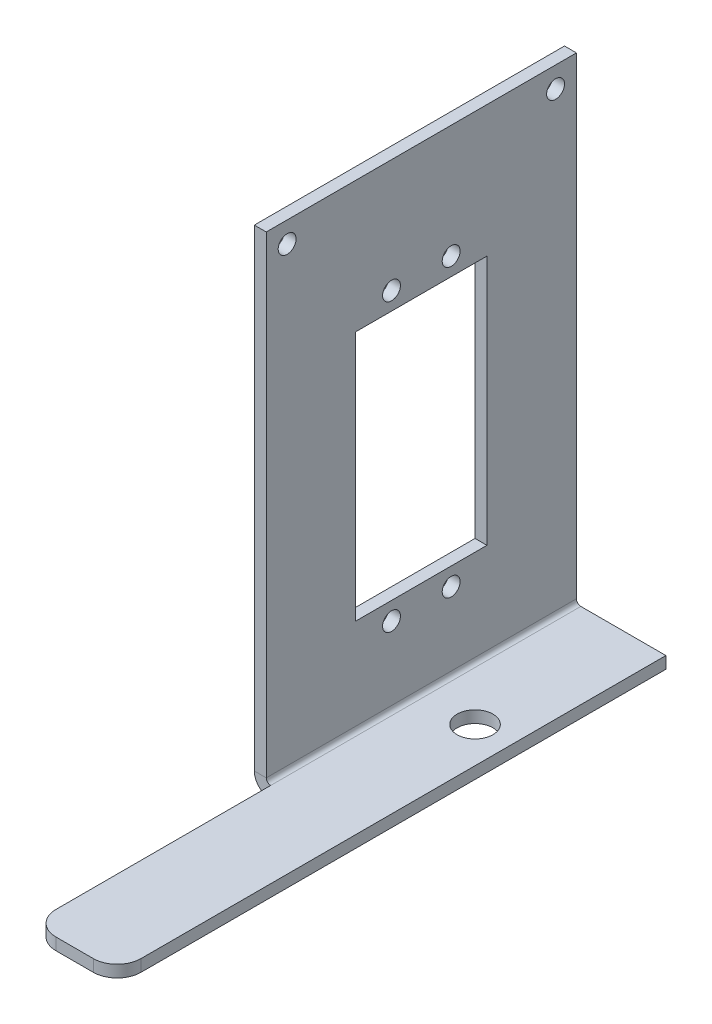
ISO-10303-21;
HEADER;
FILE_DESCRIPTION(('STEP AP214'),'2;1');
FILE_NAME('part.step','',(''),(''),'','','');
FILE_SCHEMA(('AUTOMOTIVE_DESIGN { 1 0 10303 214 1 1 1 1 }'));
ENDSEC;
DATA;
#1=APPLICATION_CONTEXT('core data for automotive mechanical design processes');
#2=APPLICATION_PROTOCOL_DEFINITION('international standard','automotive_design',2000,#1);
#3=PRODUCT_CONTEXT('',#1,'mechanical');
#4=PRODUCT('Part','Part','',(#3));
#5=PRODUCT_RELATED_PRODUCT_CATEGORY('part','',(#4));
#6=PRODUCT_DEFINITION_FORMATION('','',#4);
#7=PRODUCT_DEFINITION_CONTEXT('part definition',#1,'design');
#8=PRODUCT_DEFINITION('design','',#6,#7);
#9=PRODUCT_DEFINITION_SHAPE('','',#8);
#10=(LENGTH_UNIT() NAMED_UNIT(*) SI_UNIT(.MILLI.,.METRE.));
#11=(NAMED_UNIT(*) PLANE_ANGLE_UNIT() SI_UNIT($,.RADIAN.));
#12=(NAMED_UNIT(*) SI_UNIT($,.STERADIAN.) SOLID_ANGLE_UNIT());
#13=UNCERTAINTY_MEASURE_WITH_UNIT(LENGTH_MEASURE(1.E-05),#10,'distance_accuracy_value','');
#14=(GEOMETRIC_REPRESENTATION_CONTEXT(3) GLOBAL_UNCERTAINTY_ASSIGNED_CONTEXT((#13)) GLOBAL_UNIT_ASSIGNED_CONTEXT((#10,
#11,#12)) REPRESENTATION_CONTEXT('',''));
#15=CARTESIAN_POINT('',(0.,0.,0.));
#16=DIRECTION('',(0.,0.,1.));
#17=DIRECTION('',(1.,0.,0.));
#18=AXIS2_PLACEMENT_3D('',#15,#16,#17);
#19=CARTESIAN_POINT('',(0.7366,0.,52.));
#20=DIRECTION('',(0.,0.,1.));
#21=DIRECTION('',(1.,0.,0.));
#22=AXIS2_PLACEMENT_3D('',#19,#20,#21);
#23=PLANE('',#22);
#24=DIRECTION('',(0.,-1.,0.));
#25=VECTOR('',#24,1.);
#26=CARTESIAN_POINT('',(0.7366,0.,52.));
#27=LINE('',#26,#25);
#28=CARTESIAN_POINT('',(0.7366,0.,52.));
#29=VERTEX_POINT('',#28);
#30=CARTESIAN_POINT('',(0.7366,-2.,52.));
#31=VERTEX_POINT('',#30);
#32=EDGE_CURVE('E286',#29,#31,#27,.T.);
#33=ORIENTED_EDGE('',*,*,#32,.F.);
#34=CARTESIAN_POINT('',(0.7366,0.7366,52.));
#35=DIRECTION('',(0.,0.,-1.));
#36=DIRECTION('',(-1.,0.,0.));
#37=AXIS2_PLACEMENT_3D('',#34,#35,#36);
#38=CIRCLE('',#37,0.7366);
#39=CARTESIAN_POINT('',(0.,0.7366,52.));
#40=VERTEX_POINT('',#39);
#41=EDGE_CURVE('E298',#40,#29,#38,.F.);
#42=ORIENTED_EDGE('',*,*,#41,.F.);
#43=DIRECTION('',(1.,0.,0.));
#44=VECTOR('',#43,1.);
#45=CARTESIAN_POINT('',(-2.,0.7366,52.));
#46=LINE('',#45,#44);
#47=CARTESIAN_POINT('',(-2.,0.7366,52.));
#48=VERTEX_POINT('',#47);
#49=EDGE_CURVE('E304',#48,#40,#46,.T.);
#50=ORIENTED_EDGE('',*,*,#49,.F.);
#51=CARTESIAN_POINT('',(0.7366,0.7366,52.));
#52=DIRECTION('',(0.,0.,1.));
#53=DIRECTION('',(1.,0.,0.));
#54=AXIS2_PLACEMENT_3D('',#51,#52,#53);
#55=CIRCLE('',#54,2.7366);
#56=EDGE_CURVE('E301',#48,#31,#55,.T.);
#57=ORIENTED_EDGE('',*,*,#56,.T.);
#58=EDGE_LOOP('',(#33,#42,#50,#57));
#59=FACE_BOUND('',#58,.T.);
#60=ADVANCED_FACE('F178',(#59),#23,.T.);
#61=CARTESIAN_POINT('',(0.,0.7366,0.));
#62=DIRECTION('',(0.,0.,-1.));
#63=DIRECTION('',(-1.,0.,0.));
#64=AXIS2_PLACEMENT_3D('',#61,#62,#63);
#65=PLANE('',#64);
#66=DIRECTION('',(-1.,0.,0.));
#67=VECTOR('',#66,1.);
#68=CARTESIAN_POINT('',(0.,0.7366,0.));
#69=LINE('',#68,#67);
#70=CARTESIAN_POINT('',(0.,0.7366,0.));
#71=VERTEX_POINT('',#70);
#72=CARTESIAN_POINT('',(-2.,0.7366,0.));
#73=VERTEX_POINT('',#72);
#74=EDGE_CURVE('E373',#71,#73,#69,.T.);
#75=ORIENTED_EDGE('',*,*,#74,.F.);
#76=CARTESIAN_POINT('',(0.7366,0.7366,0.));
#77=DIRECTION('',(0.,0.,-1.));
#78=DIRECTION('',(-1.,0.,0.));
#79=AXIS2_PLACEMENT_3D('',#76,#77,#78);
#80=CIRCLE('',#79,0.7366);
#81=CARTESIAN_POINT('',(0.7366,0.,0.));
#82=VERTEX_POINT('',#81);
#83=EDGE_CURVE('E348',#71,#82,#80,.F.);
#84=ORIENTED_EDGE('',*,*,#83,.T.);
#85=DIRECTION('',(0.,1.,0.));
#86=VECTOR('',#85,1.);
#87=CARTESIAN_POINT('',(0.7366,-2.,0.));
#88=LINE('',#87,#86);
#89=CARTESIAN_POINT('',(0.7366,-2.,0.));
#90=VERTEX_POINT('',#89);
#91=EDGE_CURVE('E371',#90,#82,#88,.T.);
#92=ORIENTED_EDGE('',*,*,#91,.F.);
#93=CARTESIAN_POINT('',(0.7366,0.7366,0.));
#94=DIRECTION('',(0.,0.,1.));
#95=DIRECTION('',(1.,0.,0.));
#96=AXIS2_PLACEMENT_3D('',#93,#94,#95);
#97=CIRCLE('',#96,2.7366);
#98=EDGE_CURVE('E322',#73,#90,#97,.T.);
#99=ORIENTED_EDGE('',*,*,#98,.F.);
#100=EDGE_LOOP('',(#75,#84,#92,#99));
#101=FACE_BOUND('',#100,.T.);
#102=ADVANCED_FACE('F497',(#101),#65,.T.);
#103=CARTESIAN_POINT('',(0.7366,-2.,0.));
#104=DIRECTION('',(0.,0.,-1.));
#105=DIRECTION('',(-1.,0.,0.));
#106=AXIS2_PLACEMENT_3D('',#103,#104,#105);
#107=PLANE('',#106);
#108=DIRECTION('',(0.,-1.,0.));
#109=VECTOR('',#108,1.);
#110=CARTESIAN_POINT('',(0.,0.,0.));
#111=LINE('',#110,#109);
#112=CARTESIAN_POINT('',(0.,80.,0.));
#113=VERTEX_POINT('',#112);
#114=EDGE_CURVE('E350',#113,#71,#111,.T.);
#115=ORIENTED_EDGE('',*,*,#114,.T.);
#116=ORIENTED_EDGE('',*,*,#74,.T.);
#117=DIRECTION('',(0.,1.,0.));
#118=VECTOR('',#117,1.);
#119=CARTESIAN_POINT('',(-2.,0.,0.));
#120=LINE('',#119,#118);
#121=CARTESIAN_POINT('',(-2.,80.,0.));
#122=VERTEX_POINT('',#121);
#123=EDGE_CURVE('E327',#122,#73,#120,.F.);
#124=ORIENTED_EDGE('',*,*,#123,.F.);
#125=DIRECTION('',(1.,0.,0.));
#126=VECTOR('',#125,1.);
#127=CARTESIAN_POINT('',(-2.,80.,0.));
#128=LINE('',#127,#126);
#129=EDGE_CURVE('E353',#122,#113,#128,.T.);
#130=ORIENTED_EDGE('',*,*,#129,.T.);
#131=EDGE_LOOP('',(#115,#116,#124,#130));
#132=FACE_BOUND('',#131,.T.);
#133=ADVANCED_FACE('F502',(#132),#107,.T.);
#134=CARTESIAN_POINT('',(0.,-2.,52.));
#135=DIRECTION('',(0.,1.,0.));
#136=DIRECTION('',(0.,0.,1.));
#137=AXIS2_PLACEMENT_3D('',#134,#135,#136);
#138=PLANE('',#137);
#139=CARTESIAN_POINT('',(9.,-2.,26.));
#140=DIRECTION('',(0.,-1.,0.));
#141=DIRECTION('',(0.,0.,-1.));
#142=AXIS2_PLACEMENT_3D('',#139,#140,#141);
#143=CIRCLE('',#142,3.);
#144=CARTESIAN_POINT('',(9.,-2.,23.));
#145=VERTEX_POINT('',#144);
#146=EDGE_CURVE('E344',#145,#145,#143,.T.);
#147=ORIENTED_EDGE('',*,*,#146,.F.);
#148=EDGE_LOOP('',(#147));
#149=FACE_BOUND('',#148,.T.);
#150=DIRECTION('',(0.,0.,-1.));
#151=VECTOR('',#150,1.);
#152=CARTESIAN_POINT('',(15.,-2.,52.));
#153=LINE('',#152,#151);
#154=CARTESIAN_POINT('',(15.,-2.,88.));
#155=VERTEX_POINT('',#154);
#156=CARTESIAN_POINT('',(15.,-2.,0.));
#157=VERTEX_POINT('',#156);
#158=EDGE_CURVE('E369',#155,#157,#153,.T.);
#159=ORIENTED_EDGE('',*,*,#158,.F.);
#160=CARTESIAN_POINT('',(11.,-2.,88.));
#161=DIRECTION('',(0.,1.,0.));
#162=DIRECTION('',(0.,0.,1.));
#163=AXIS2_PLACEMENT_3D('',#160,#161,#162);
#164=CIRCLE('',#163,4.);
#165=CARTESIAN_POINT('',(11.,-2.,92.));
#166=VERTEX_POINT('',#165);
#167=EDGE_CURVE('E397',#155,#166,#164,.F.);
#168=ORIENTED_EDGE('',*,*,#167,.T.);
#169=DIRECTION('',(1.,0.,0.));
#170=VECTOR('',#169,1.);
#171=CARTESIAN_POINT('',(15.,-2.,92.));
#172=LINE('',#171,#170);
#173=CARTESIAN_POINT('',(4.7366,-2.,92.));
#174=VERTEX_POINT('',#173);
#175=EDGE_CURVE('E292',#174,#166,#172,.T.);
#176=ORIENTED_EDGE('',*,*,#175,.F.);
#177=CARTESIAN_POINT('',(4.7366,-2.,88.));
#178=DIRECTION('',(0.,1.,0.));
#179=DIRECTION('',(0.,0.,1.));
#180=AXIS2_PLACEMENT_3D('',#177,#178,#179);
#181=CIRCLE('',#180,4.);
#182=CARTESIAN_POINT('',(0.7366,-2.,88.));
#183=VERTEX_POINT('',#182);
#184=EDGE_CURVE('E395',#174,#183,#181,.F.);
#185=ORIENTED_EDGE('',*,*,#184,.T.);
#186=DIRECTION('',(0.,0.,1.));
#187=VECTOR('',#186,1.);
#188=CARTESIAN_POINT('',(0.7366,-2.,92.));
#189=LINE('',#188,#187);
#190=EDGE_CURVE('E418',#31,#183,#189,.T.);
#191=ORIENTED_EDGE('',*,*,#190,.F.);
#192=DIRECTION('',(0.,0.,-1.));
#193=VECTOR('',#192,1.);
#194=CARTESIAN_POINT('',(0.7366,-2.,52.));
#195=LINE('',#194,#193);
#196=EDGE_CURVE('E339',#31,#90,#195,.T.);
#197=ORIENTED_EDGE('',*,*,#196,.T.);
#198=DIRECTION('',(1.,0.,0.));
#199=VECTOR('',#198,1.);
#200=CARTESIAN_POINT('',(0.,-2.,0.));
#201=LINE('',#200,#199);
#202=EDGE_CURVE('E340',#90,#157,#201,.T.);
#203=ORIENTED_EDGE('',*,*,#202,.T.);
#204=EDGE_LOOP('',(#159,#168,#176,#185,#191,#197,#203));
#205=FACE_BOUND('',#204,.T.);
#206=ADVANCED_FACE('F415',(#149,#205),#138,.F.);
#207=CARTESIAN_POINT('',(15.,0.,52.));
#208=DIRECTION('',(1.,0.,0.));
#209=DIRECTION('',(0.,0.,-1.));
#210=AXIS2_PLACEMENT_3D('',#207,#208,#209);
#211=PLANE('',#210);
#212=DIRECTION('',(0.,0.,-1.));
#213=VECTOR('',#212,1.);
#214=CARTESIAN_POINT('',(15.,0.,52.));
#215=LINE('',#214,#213);
#216=CARTESIAN_POINT('',(15.,0.,88.));
#217=VERTEX_POINT('',#216);
#218=CARTESIAN_POINT('',(15.,0.,0.));
#219=VERTEX_POINT('',#218);
#220=EDGE_CURVE('E315',#217,#219,#215,.T.);
#221=ORIENTED_EDGE('',*,*,#220,.F.);
#222=DIRECTION('',(0.,-1.,0.));
#223=VECTOR('',#222,1.);
#224=CARTESIAN_POINT('',(15.,-2.,88.));
#225=LINE('',#224,#223);
#226=EDGE_CURVE('E392',#217,#155,#225,.T.);
#227=ORIENTED_EDGE('',*,*,#226,.T.);
#228=ORIENTED_EDGE('',*,*,#158,.T.);
#229=DIRECTION('',(0.,-1.,0.));
#230=VECTOR('',#229,1.);
#231=CARTESIAN_POINT('',(15.,0.,0.));
#232=LINE('',#231,#230);
#233=EDGE_CURVE('E343',#219,#157,#232,.T.);
#234=ORIENTED_EDGE('',*,*,#233,.F.);
#235=EDGE_LOOP('',(#221,#227,#228,#234));
#236=FACE_BOUND('',#235,.T.);
#237=ADVANCED_FACE('F410',(#236),#211,.T.);
#238=CARTESIAN_POINT('',(0.,0.,52.));
#239=DIRECTION('',(0.,1.,0.));
#240=DIRECTION('',(0.,0.,1.));
#241=AXIS2_PLACEMENT_3D('',#238,#239,#240);
#242=PLANE('',#241);
#243=CARTESIAN_POINT('',(9.,0.,26.));
#244=DIRECTION('',(0.,1.,0.));
#245=DIRECTION('',(0.,0.,1.));
#246=AXIS2_PLACEMENT_3D('',#243,#244,#245);
#247=CIRCLE('',#246,3.);
#248=CARTESIAN_POINT('',(9.,0.,29.));
#249=VERTEX_POINT('',#248);
#250=EDGE_CURVE('E330',#249,#249,#247,.F.);
#251=ORIENTED_EDGE('',*,*,#250,.T.);
#252=EDGE_LOOP('',(#251));
#253=FACE_BOUND('',#252,.T.);
#254=DIRECTION('',(1.,0.,0.));
#255=VECTOR('',#254,1.);
#256=CARTESIAN_POINT('',(15.,0.,92.));
#257=LINE('',#256,#255);
#258=CARTESIAN_POINT('',(4.7366,0.,92.));
#259=VERTEX_POINT('',#258);
#260=CARTESIAN_POINT('',(11.,0.,92.));
#261=VERTEX_POINT('',#260);
#262=EDGE_CURVE('E291',#259,#261,#257,.T.);
#263=ORIENTED_EDGE('',*,*,#262,.T.);
#264=CARTESIAN_POINT('',(11.,0.,88.));
#265=DIRECTION('',(0.,1.,0.));
#266=DIRECTION('',(0.,0.,1.));
#267=AXIS2_PLACEMENT_3D('',#264,#265,#266);
#268=CIRCLE('',#267,4.);
#269=EDGE_CURVE('E186',#261,#217,#268,.T.);
#270=ORIENTED_EDGE('',*,*,#269,.T.);
#271=ORIENTED_EDGE('',*,*,#220,.T.);
#272=DIRECTION('',(1.,0.,0.));
#273=VECTOR('',#272,1.);
#274=CARTESIAN_POINT('',(0.,0.,0.));
#275=LINE('',#274,#273);
#276=EDGE_CURVE('E311',#82,#219,#275,.T.);
#277=ORIENTED_EDGE('',*,*,#276,.F.);
#278=DIRECTION('',(0.,0.,-1.));
#279=VECTOR('',#278,1.);
#280=CARTESIAN_POINT('',(0.7366,0.,52.));
#281=LINE('',#280,#279);
#282=EDGE_CURVE('E308',#29,#82,#281,.T.);
#283=ORIENTED_EDGE('',*,*,#282,.F.);
#284=DIRECTION('',(0.,0.,1.));
#285=VECTOR('',#284,1.);
#286=CARTESIAN_POINT('',(0.7366,0.,92.));
#287=LINE('',#286,#285);
#288=CARTESIAN_POINT('',(0.7366,0.,88.));
#289=VERTEX_POINT('',#288);
#290=EDGE_CURVE('E283',#29,#289,#287,.T.);
#291=ORIENTED_EDGE('',*,*,#290,.T.);
#292=CARTESIAN_POINT('',(4.7366,0.,88.));
#293=DIRECTION('',(0.,1.,0.));
#294=DIRECTION('',(0.,0.,1.));
#295=AXIS2_PLACEMENT_3D('',#292,#293,#294);
#296=CIRCLE('',#295,4.);
#297=EDGE_CURVE('E403',#289,#259,#296,.T.);
#298=ORIENTED_EDGE('',*,*,#297,.T.);
#299=EDGE_LOOP('',(#263,#270,#271,#277,#283,#291,#298));
#300=FACE_BOUND('',#299,.T.);
#301=ADVANCED_FACE('F309',(#253,#300),#242,.T.);
#302=CARTESIAN_POINT('',(0.7366,0.7366,52.));
#303=DIRECTION('',(0.,0.,-1.));
#304=DIRECTION('',(-1.,0.,0.));
#305=AXIS2_PLACEMENT_3D('',#302,#303,#304);
#306=CYLINDRICAL_SURFACE('',#305,0.7366);
#307=ORIENTED_EDGE('',*,*,#83,.F.);
#308=DIRECTION('',(0.,0.,-1.));
#309=VECTOR('',#308,1.);
#310=CARTESIAN_POINT('',(0.,0.7366,52.));
#311=LINE('',#310,#309);
#312=EDGE_CURVE('E316',#40,#71,#311,.T.);
#313=ORIENTED_EDGE('',*,*,#312,.F.);
#314=ORIENTED_EDGE('',*,*,#41,.T.);
#315=ORIENTED_EDGE('',*,*,#282,.T.);
#316=EDGE_LOOP('',(#307,#313,#314,#315));
#317=FACE_BOUND('',#316,.T.);
#318=ADVANCED_FACE('F319',(#317),#306,.F.);
#319=CARTESIAN_POINT('',(0.,0.,52.));
#320=DIRECTION('',(1.,0.,0.));
#321=DIRECTION('',(0.,0.,-1.));
#322=AXIS2_PLACEMENT_3D('',#319,#320,#321);
#323=PLANE('',#322);
#324=DIRECTION('',(0.,1.,0.));
#325=VECTOR('',#324,1.);
#326=CARTESIAN_POINT('',(0.,16.,15.));
#327=LINE('',#326,#325);
#328=CARTESIAN_POINT('',(0.,16.,15.));
#329=VERTEX_POINT('',#328);
#330=CARTESIAN_POINT('',(0.,58.,15.));
#331=VERTEX_POINT('',#330);
#332=EDGE_CURVE('E423',#329,#331,#327,.T.);
#333=ORIENTED_EDGE('',*,*,#332,.F.);
#334=DIRECTION('',(0.,0.,-1.));
#335=VECTOR('',#334,1.);
#336=CARTESIAN_POINT('',(0.,16.,15.));
#337=LINE('',#336,#335);
#338=CARTESIAN_POINT('',(0.,16.,37.));
#339=VERTEX_POINT('',#338);
#340=EDGE_CURVE('E431',#339,#329,#337,.T.);
#341=ORIENTED_EDGE('',*,*,#340,.F.);
#342=DIRECTION('',(0.,-1.,0.));
#343=VECTOR('',#342,1.);
#344=CARTESIAN_POINT('',(0.,16.,37.));
#345=LINE('',#344,#343);
#346=CARTESIAN_POINT('',(0.,58.,37.));
#347=VERTEX_POINT('',#346);
#348=EDGE_CURVE('E428',#347,#339,#345,.T.);
#349=ORIENTED_EDGE('',*,*,#348,.F.);
#350=DIRECTION('',(0.,0.,1.));
#351=VECTOR('',#350,1.);
#352=CARTESIAN_POINT('',(0.,58.,15.));
#353=LINE('',#352,#351);
#354=EDGE_CURVE('E425',#331,#347,#353,.T.);
#355=ORIENTED_EDGE('',*,*,#354,.F.);
#356=EDGE_LOOP('',(#333,#341,#349,#355));
#357=FACE_BOUND('',#356,.T.);
#358=CARTESIAN_POINT('',(0.,61.,21.));
#359=DIRECTION('',(1.,0.,0.));
#360=DIRECTION('',(0.,0.,-1.));
#361=AXIS2_PLACEMENT_3D('',#358,#359,#360);
#362=CIRCLE('',#361,1.49999999999999);
#363=CARTESIAN_POINT('',(0.,61.,19.5));
#364=VERTEX_POINT('',#363);
#365=EDGE_CURVE('E446',#364,#364,#362,.T.);
#366=ORIENTED_EDGE('',*,*,#365,.F.);
#367=EDGE_LOOP('',(#366));
#368=FACE_BOUND('',#367,.T.);
#369=CARTESIAN_POINT('',(0.,13.,21.));
#370=DIRECTION('',(1.,0.,0.));
#371=DIRECTION('',(0.,0.,-1.));
#372=AXIS2_PLACEMENT_3D('',#369,#370,#371);
#373=CIRCLE('',#372,1.5);
#374=CARTESIAN_POINT('',(0.,13.,19.5));
#375=VERTEX_POINT('',#374);
#376=EDGE_CURVE('E452',#375,#375,#373,.T.);
#377=ORIENTED_EDGE('',*,*,#376,.F.);
#378=EDGE_LOOP('',(#377));
#379=FACE_BOUND('',#378,.T.);
#380=CARTESIAN_POINT('',(0.,13.,31.));
#381=DIRECTION('',(1.,0.,0.));
#382=DIRECTION('',(0.,0.,-1.));
#383=AXIS2_PLACEMENT_3D('',#380,#381,#382);
#384=CIRCLE('',#383,1.5);
#385=CARTESIAN_POINT('',(0.,13.,29.5));
#386=VERTEX_POINT('',#385);
#387=EDGE_CURVE('E458',#386,#386,#384,.T.);
#388=ORIENTED_EDGE('',*,*,#387,.F.);
#389=EDGE_LOOP('',(#388));
#390=FACE_BOUND('',#389,.T.);
#391=CARTESIAN_POINT('',(0.,61.,31.));
#392=DIRECTION('',(1.,0.,0.));
#393=DIRECTION('',(0.,0.,-1.));
#394=AXIS2_PLACEMENT_3D('',#391,#392,#393);
#395=CIRCLE('',#394,1.49999999999999);
#396=CARTESIAN_POINT('',(0.,61.,29.5));
#397=VERTEX_POINT('',#396);
#398=EDGE_CURVE('E464',#397,#397,#395,.T.);
#399=ORIENTED_EDGE('',*,*,#398,.F.);
#400=EDGE_LOOP('',(#399));
#401=FACE_BOUND('',#400,.T.);
#402=CARTESIAN_POINT('',(0.,76.5,3.5));
#403=DIRECTION('',(1.,0.,0.));
#404=DIRECTION('',(0.,0.,-1.));
#405=AXIS2_PLACEMENT_3D('',#402,#403,#404);
#406=CIRCLE('',#405,1.49999999999999);
#407=CARTESIAN_POINT('',(0.,76.5,2.));
#408=VERTEX_POINT('',#407);
#409=EDGE_CURVE('E376',#408,#408,#406,.T.);
#410=ORIENTED_EDGE('',*,*,#409,.F.);
#411=EDGE_LOOP('',(#410));
#412=FACE_BOUND('',#411,.T.);
#413=CARTESIAN_POINT('',(0.,76.5,48.5));
#414=DIRECTION('',(1.,0.,0.));
#415=DIRECTION('',(0.,0.,-1.));
#416=AXIS2_PLACEMENT_3D('',#413,#414,#415);
#417=CIRCLE('',#416,1.49999999999999);
#418=CARTESIAN_POINT('',(0.,76.5,47.));
#419=VERTEX_POINT('',#418);
#420=EDGE_CURVE('E471',#419,#419,#417,.T.);
#421=ORIENTED_EDGE('',*,*,#420,.F.);
#422=EDGE_LOOP('',(#421));
#423=FACE_BOUND('',#422,.T.);
#424=ORIENTED_EDGE('',*,*,#114,.F.);
#425=DIRECTION('',(0.,0.,-1.));
#426=VECTOR('',#425,1.);
#427=CARTESIAN_POINT('',(0.,80.,52.));
#428=LINE('',#427,#426);
#429=CARTESIAN_POINT('',(0.,80.,52.));
#430=VERTEX_POINT('',#429);
#431=EDGE_CURVE('E365',#430,#113,#428,.T.);
#432=ORIENTED_EDGE('',*,*,#431,.F.);
#433=DIRECTION('',(0.,-1.,0.));
#434=VECTOR('',#433,1.);
#435=CARTESIAN_POINT('',(0.,0.,52.));
#436=LINE('',#435,#434);
#437=EDGE_CURVE('E321',#430,#40,#436,.T.);
#438=ORIENTED_EDGE('',*,*,#437,.T.);
#439=ORIENTED_EDGE('',*,*,#312,.T.);
#440=EDGE_LOOP('',(#424,#432,#438,#439));
#441=FACE_BOUND('',#440,.T.);
#442=ADVANCED_FACE('F577',(#357,#368,#379,#390,#401,#412,#423,#441),#323,.T.);
#443=CARTESIAN_POINT('',(-2.,80.,52.));
#444=DIRECTION('',(0.,1.,0.));
#445=DIRECTION('',(0.,0.,1.));
#446=AXIS2_PLACEMENT_3D('',#443,#444,#445);
#447=PLANE('',#446);
#448=ORIENTED_EDGE('',*,*,#129,.F.);
#449=DIRECTION('',(0.,0.,-1.));
#450=VECTOR('',#449,1.);
#451=CARTESIAN_POINT('',(-2.,80.,52.));
#452=LINE('',#451,#450);
#453=CARTESIAN_POINT('',(-2.,80.,52.));
#454=VERTEX_POINT('',#453);
#455=EDGE_CURVE('E363',#454,#122,#452,.T.);
#456=ORIENTED_EDGE('',*,*,#455,.F.);
#457=DIRECTION('',(1.,0.,0.));
#458=VECTOR('',#457,1.);
#459=CARTESIAN_POINT('',(-2.,80.,52.));
#460=LINE('',#459,#458);
#461=EDGE_CURVE('E324',#454,#430,#460,.T.);
#462=ORIENTED_EDGE('',*,*,#461,.T.);
#463=ORIENTED_EDGE('',*,*,#431,.T.);
#464=EDGE_LOOP('',(#448,#456,#462,#463));
#465=FACE_BOUND('',#464,.T.);
#466=ADVANCED_FACE('F562',(#465),#447,.T.);
#467=CARTESIAN_POINT('',(-2.,0.,52.));
#468=DIRECTION('',(1.,0.,0.));
#469=DIRECTION('',(0.,0.,-1.));
#470=AXIS2_PLACEMENT_3D('',#467,#468,#469);
#471=PLANE('',#470);
#472=DIRECTION('',(0.,0.,-1.));
#473=VECTOR('',#472,1.);
#474=CARTESIAN_POINT('',(-2.,16.,52.));
#475=LINE('',#474,#473);
#476=CARTESIAN_POINT('',(-2.,16.,37.));
#477=VERTEX_POINT('',#476);
#478=CARTESIAN_POINT('',(-2.,16.,15.));
#479=VERTEX_POINT('',#478);
#480=EDGE_CURVE('E386',#477,#479,#475,.T.);
#481=ORIENTED_EDGE('',*,*,#480,.T.);
#482=DIRECTION('',(0.,1.,0.));
#483=VECTOR('',#482,1.);
#484=CARTESIAN_POINT('',(-2.,0.,15.));
#485=LINE('',#484,#483);
#486=CARTESIAN_POINT('',(-2.,58.,15.));
#487=VERTEX_POINT('',#486);
#488=EDGE_CURVE('E389',#479,#487,#485,.T.);
#489=ORIENTED_EDGE('',*,*,#488,.T.);
#490=DIRECTION('',(0.,0.,1.));
#491=VECTOR('',#490,1.);
#492=CARTESIAN_POINT('',(-2.,58.,52.));
#493=LINE('',#492,#491);
#494=CARTESIAN_POINT('',(-2.,58.,37.));
#495=VERTEX_POINT('',#494);
#496=EDGE_CURVE('E303',#487,#495,#493,.T.);
#497=ORIENTED_EDGE('',*,*,#496,.T.);
#498=DIRECTION('',(0.,-1.,0.));
#499=VECTOR('',#498,1.);
#500=CARTESIAN_POINT('',(-2.,0.,37.));
#501=LINE('',#500,#499);
#502=EDGE_CURVE('E383',#495,#477,#501,.T.);
#503=ORIENTED_EDGE('',*,*,#502,.T.);
#504=EDGE_LOOP('',(#481,#489,#497,#503));
#505=FACE_BOUND('',#504,.T.);
#506=CARTESIAN_POINT('',(-2.,61.,21.));
#507=DIRECTION('',(-1.,0.,0.));
#508=DIRECTION('',(0.,0.,1.));
#509=AXIS2_PLACEMENT_3D('',#506,#507,#508);
#510=CIRCLE('',#509,1.49999999999999);
#511=CARTESIAN_POINT('',(-2.,61.,22.5));
#512=VERTEX_POINT('',#511);
#513=EDGE_CURVE('E437',#512,#512,#510,.T.);
#514=ORIENTED_EDGE('',*,*,#513,.F.);
#515=EDGE_LOOP('',(#514));
#516=FACE_BOUND('',#515,.T.);
#517=CARTESIAN_POINT('',(-2.,13.,21.));
#518=DIRECTION('',(-1.,0.,0.));
#519=DIRECTION('',(0.,0.,1.));
#520=AXIS2_PLACEMENT_3D('',#517,#518,#519);
#521=CIRCLE('',#520,1.49999999999999);
#522=CARTESIAN_POINT('',(-2.,13.,22.5));
#523=VERTEX_POINT('',#522);
#524=EDGE_CURVE('E449',#523,#523,#521,.T.);
#525=ORIENTED_EDGE('',*,*,#524,.F.);
#526=EDGE_LOOP('',(#525));
#527=FACE_BOUND('',#526,.T.);
#528=CARTESIAN_POINT('',(-2.,13.,31.));
#529=DIRECTION('',(-1.,0.,0.));
#530=DIRECTION('',(0.,0.,1.));
#531=AXIS2_PLACEMENT_3D('',#528,#529,#530);
#532=CIRCLE('',#531,1.49999999999999);
#533=CARTESIAN_POINT('',(-2.,13.,32.5));
#534=VERTEX_POINT('',#533);
#535=EDGE_CURVE('E455',#534,#534,#532,.T.);
#536=ORIENTED_EDGE('',*,*,#535,.F.);
#537=EDGE_LOOP('',(#536));
#538=FACE_BOUND('',#537,.T.);
#539=CARTESIAN_POINT('',(-2.,61.,31.));
#540=DIRECTION('',(-1.,0.,0.));
#541=DIRECTION('',(0.,0.,1.));
#542=AXIS2_PLACEMENT_3D('',#539,#540,#541);
#543=CIRCLE('',#542,1.49999999999999);
#544=CARTESIAN_POINT('',(-2.,61.,32.5));
#545=VERTEX_POINT('',#544);
#546=EDGE_CURVE('E461',#545,#545,#543,.T.);
#547=ORIENTED_EDGE('',*,*,#546,.F.);
#548=EDGE_LOOP('',(#547));
#549=FACE_BOUND('',#548,.T.);
#550=CARTESIAN_POINT('',(-2.,76.5,3.5));
#551=DIRECTION('',(-1.,0.,0.));
#552=DIRECTION('',(0.,0.,1.));
#553=AXIS2_PLACEMENT_3D('',#550,#551,#552);
#554=CIRCLE('',#553,1.49999999999999);
#555=CARTESIAN_POINT('',(-2.,76.5,4.99999999999998));
#556=VERTEX_POINT('',#555);
#557=EDGE_CURVE('E380',#556,#556,#554,.T.);
#558=ORIENTED_EDGE('',*,*,#557,.F.);
#559=EDGE_LOOP('',(#558));
#560=FACE_BOUND('',#559,.T.);
#561=CARTESIAN_POINT('',(-2.,76.5,48.5));
#562=DIRECTION('',(-1.,0.,0.));
#563=DIRECTION('',(0.,0.,1.));
#564=AXIS2_PLACEMENT_3D('',#561,#562,#563);
#565=CIRCLE('',#564,1.49999999999999);
#566=CARTESIAN_POINT('',(-2.,76.5,50.));
#567=VERTEX_POINT('',#566);
#568=EDGE_CURVE('E379',#567,#567,#565,.T.);
#569=ORIENTED_EDGE('',*,*,#568,.F.);
#570=EDGE_LOOP('',(#569));
#571=FACE_BOUND('',#570,.T.);
#572=ORIENTED_EDGE('',*,*,#123,.T.);
#573=DIRECTION('',(0.,0.,-1.));
#574=VECTOR('',#573,1.);
#575=CARTESIAN_POINT('',(-2.,0.7366,52.));
#576=LINE('',#575,#574);
#577=EDGE_CURVE('E360',#48,#73,#576,.T.);
#578=ORIENTED_EDGE('',*,*,#577,.F.);
#579=DIRECTION('',(0.,1.,0.));
#580=VECTOR('',#579,1.);
#581=CARTESIAN_POINT('',(-2.,0.,52.));
#582=LINE('',#581,#580);
#583=EDGE_CURVE('E335',#454,#48,#582,.F.);
#584=ORIENTED_EDGE('',*,*,#583,.F.);
#585=ORIENTED_EDGE('',*,*,#455,.T.);
#586=EDGE_LOOP('',(#572,#578,#584,#585));
#587=FACE_BOUND('',#586,.T.);
#588=ADVANCED_FACE('F558',(#505,#516,#527,#538,#549,#560,#571,#587),#471,.F.);
#589=CARTESIAN_POINT('',(0.7366,0.7366,52.));
#590=DIRECTION('',(0.,0.,-1.));
#591=DIRECTION('',(-1.,0.,0.));
#592=AXIS2_PLACEMENT_3D('',#589,#590,#591);
#593=CYLINDRICAL_SURFACE('',#592,2.7366);
#594=ORIENTED_EDGE('',*,*,#98,.T.);
#595=ORIENTED_EDGE('',*,*,#196,.F.);
#596=ORIENTED_EDGE('',*,*,#56,.F.);
#597=ORIENTED_EDGE('',*,*,#577,.T.);
#598=EDGE_LOOP('',(#594,#595,#596,#597));
#599=FACE_BOUND('',#598,.T.);
#600=ADVANCED_FACE('F561',(#599),#593,.T.);
#601=CARTESIAN_POINT('',(0.7366,0.7366,52.));
#602=DIRECTION('',(0.,0.,-1.));
#603=DIRECTION('',(-1.,0.,0.));
#604=AXIS2_PLACEMENT_3D('',#601,#602,#603);
#605=PLANE('',#604);
#606=ORIENTED_EDGE('',*,*,#583,.T.);
#607=ORIENTED_EDGE('',*,*,#49,.T.);
#608=ORIENTED_EDGE('',*,*,#437,.F.);
#609=ORIENTED_EDGE('',*,*,#461,.F.);
#610=EDGE_LOOP('',(#606,#607,#608,#609));
#611=FACE_BOUND('',#610,.T.);
#612=ADVANCED_FACE('F492',(#611),#605,.F.);
#613=CARTESIAN_POINT('',(0.7366,0.7366,0.));
#614=DIRECTION('',(0.,0.,-1.));
#615=DIRECTION('',(-1.,0.,0.));
#616=AXIS2_PLACEMENT_3D('',#613,#614,#615);
#617=PLANE('',#616);
#618=ORIENTED_EDGE('',*,*,#202,.F.);
#619=ORIENTED_EDGE('',*,*,#91,.T.);
#620=ORIENTED_EDGE('',*,*,#276,.T.);
#621=ORIENTED_EDGE('',*,*,#233,.T.);
#622=EDGE_LOOP('',(#618,#619,#620,#621));
#623=FACE_BOUND('',#622,.T.);
#624=ADVANCED_FACE('F483',(#623),#617,.T.);
#625=CARTESIAN_POINT('',(9.,80.001,26.));
#626=DIRECTION('',(0.,-1.,0.));
#627=DIRECTION('',(0.,0.,-1.));
#628=AXIS2_PLACEMENT_3D('',#625,#626,#627);
#629=CYLINDRICAL_SURFACE('',#628,3.);
#630=ORIENTED_EDGE('',*,*,#250,.F.);
#631=EDGE_LOOP('',(#630));
#632=FACE_BOUND('',#631,.T.);
#633=ORIENTED_EDGE('',*,*,#146,.T.);
#634=EDGE_LOOP('',(#633));
#635=FACE_BOUND('',#634,.T.);
#636=ADVANCED_FACE('F480',(#632,#635),#629,.F.);
#637=CARTESIAN_POINT('',(-2.,76.5,48.5));
#638=DIRECTION('',(-1.,0.,0.));
#639=DIRECTION('',(0.,0.,1.));
#640=AXIS2_PLACEMENT_3D('',#637,#638,#639);
#641=CYLINDRICAL_SURFACE('',#640,1.49999999999999);
#642=ORIENTED_EDGE('',*,*,#420,.T.);
#643=EDGE_LOOP('',(#642));
#644=FACE_BOUND('',#643,.T.);
#645=ORIENTED_EDGE('',*,*,#568,.T.);
#646=EDGE_LOOP('',(#645));
#647=FACE_BOUND('',#646,.T.);
#648=ADVANCED_FACE('F482',(#644,#647),#641,.F.);
#649=CARTESIAN_POINT('',(-2.,76.5,3.5));
#650=DIRECTION('',(-1.,0.,0.));
#651=DIRECTION('',(0.,0.,1.));
#652=AXIS2_PLACEMENT_3D('',#649,#650,#651);
#653=CYLINDRICAL_SURFACE('',#652,1.49999999999999);
#654=ORIENTED_EDGE('',*,*,#409,.T.);
#655=EDGE_LOOP('',(#654));
#656=FACE_BOUND('',#655,.T.);
#657=ORIENTED_EDGE('',*,*,#557,.T.);
#658=EDGE_LOOP('',(#657));
#659=FACE_BOUND('',#658,.T.);
#660=ADVANCED_FACE('F489',(#656,#659),#653,.F.);
#661=CARTESIAN_POINT('',(-2.,61.,31.));
#662=DIRECTION('',(-1.,0.,0.));
#663=DIRECTION('',(0.,0.,1.));
#664=AXIS2_PLACEMENT_3D('',#661,#662,#663);
#665=CYLINDRICAL_SURFACE('',#664,1.49999999999999);
#666=ORIENTED_EDGE('',*,*,#398,.T.);
#667=EDGE_LOOP('',(#666));
#668=FACE_BOUND('',#667,.T.);
#669=ORIENTED_EDGE('',*,*,#546,.T.);
#670=EDGE_LOOP('',(#669));
#671=FACE_BOUND('',#670,.T.);
#672=ADVANCED_FACE('F545',(#668,#671),#665,.F.);
#673=CARTESIAN_POINT('',(-2.,13.,31.));
#674=DIRECTION('',(-1.,0.,0.));
#675=DIRECTION('',(0.,0.,1.));
#676=AXIS2_PLACEMENT_3D('',#673,#674,#675);
#677=CYLINDRICAL_SURFACE('',#676,1.5);
#678=ORIENTED_EDGE('',*,*,#387,.T.);
#679=EDGE_LOOP('',(#678));
#680=FACE_BOUND('',#679,.T.);
#681=ORIENTED_EDGE('',*,*,#535,.T.);
#682=EDGE_LOOP('',(#681));
#683=FACE_BOUND('',#682,.T.);
#684=ADVANCED_FACE('F541',(#680,#683),#677,.F.);
#685=CARTESIAN_POINT('',(-2.,13.,21.));
#686=DIRECTION('',(-1.,0.,0.));
#687=DIRECTION('',(0.,0.,1.));
#688=AXIS2_PLACEMENT_3D('',#685,#686,#687);
#689=CYLINDRICAL_SURFACE('',#688,1.5);
#690=ORIENTED_EDGE('',*,*,#376,.T.);
#691=EDGE_LOOP('',(#690));
#692=FACE_BOUND('',#691,.T.);
#693=ORIENTED_EDGE('',*,*,#524,.T.);
#694=EDGE_LOOP('',(#693));
#695=FACE_BOUND('',#694,.T.);
#696=ADVANCED_FACE('F537',(#692,#695),#689,.F.);
#697=CARTESIAN_POINT('',(-2.,61.,21.));
#698=DIRECTION('',(-1.,0.,0.));
#699=DIRECTION('',(0.,0.,1.));
#700=AXIS2_PLACEMENT_3D('',#697,#698,#699);
#701=CYLINDRICAL_SURFACE('',#700,1.49999999999999);
#702=ORIENTED_EDGE('',*,*,#365,.T.);
#703=EDGE_LOOP('',(#702));
#704=FACE_BOUND('',#703,.T.);
#705=ORIENTED_EDGE('',*,*,#513,.T.);
#706=EDGE_LOOP('',(#705));
#707=FACE_BOUND('',#706,.T.);
#708=ADVANCED_FACE('F533',(#704,#707),#701,.F.);
#709=CARTESIAN_POINT('',(-10.,16.,15.));
#710=DIRECTION('',(0.,0.,-1.));
#711=DIRECTION('',(0.,1.,0.));
#712=AXIS2_PLACEMENT_3D('',#709,#710,#711);
#713=PLANE('',#712);
#714=DIRECTION('',(1.,0.,0.));
#715=VECTOR('',#714,1.);
#716=CARTESIAN_POINT('',(-10.,16.,15.));
#717=LINE('',#716,#715);
#718=EDGE_CURVE('E435',#479,#329,#717,.T.);
#719=ORIENTED_EDGE('',*,*,#718,.T.);
#720=ORIENTED_EDGE('',*,*,#332,.T.);
#721=DIRECTION('',(1.,0.,0.));
#722=VECTOR('',#721,1.);
#723=CARTESIAN_POINT('',(-10.,58.,15.));
#724=LINE('',#723,#722);
#725=EDGE_CURVE('E434',#487,#331,#724,.T.);
#726=ORIENTED_EDGE('',*,*,#725,.F.);
#727=ORIENTED_EDGE('',*,*,#488,.F.);
#728=EDGE_LOOP('',(#719,#720,#726,#727));
#729=FACE_BOUND('',#728,.T.);
#730=ADVANCED_FACE('F523',(#729),#713,.F.);
#731=CARTESIAN_POINT('',(-10.,16.,15.));
#732=DIRECTION('',(0.,-1.,0.));
#733=DIRECTION('',(0.,0.,-1.));
#734=AXIS2_PLACEMENT_3D('',#731,#732,#733);
#735=PLANE('',#734);
#736=DIRECTION('',(1.,0.,0.));
#737=VECTOR('',#736,1.);
#738=CARTESIAN_POINT('',(-10.,16.,37.));
#739=LINE('',#738,#737);
#740=EDGE_CURVE('E438',#477,#339,#739,.T.);
#741=ORIENTED_EDGE('',*,*,#740,.T.);
#742=ORIENTED_EDGE('',*,*,#340,.T.);
#743=ORIENTED_EDGE('',*,*,#718,.F.);
#744=ORIENTED_EDGE('',*,*,#480,.F.);
#745=EDGE_LOOP('',(#741,#742,#743,#744));
#746=FACE_BOUND('',#745,.T.);
#747=ADVANCED_FACE('F519',(#746),#735,.F.);
#748=CARTESIAN_POINT('',(-10.,16.,37.));
#749=DIRECTION('',(0.,0.,1.));
#750=DIRECTION('',(0.,-1.,0.));
#751=AXIS2_PLACEMENT_3D('',#748,#749,#750);
#752=PLANE('',#751);
#753=DIRECTION('',(1.,0.,0.));
#754=VECTOR('',#753,1.);
#755=CARTESIAN_POINT('',(-10.,58.,37.));
#756=LINE('',#755,#754);
#757=EDGE_CURVE('E440',#495,#347,#756,.T.);
#758=ORIENTED_EDGE('',*,*,#757,.T.);
#759=ORIENTED_EDGE('',*,*,#348,.T.);
#760=ORIENTED_EDGE('',*,*,#740,.F.);
#761=ORIENTED_EDGE('',*,*,#502,.F.);
#762=EDGE_LOOP('',(#758,#759,#760,#761));
#763=FACE_BOUND('',#762,.T.);
#764=ADVANCED_FACE('F522',(#763),#752,.F.);
#765=CARTESIAN_POINT('',(-10.,58.,15.));
#766=DIRECTION('',(0.,1.,0.));
#767=DIRECTION('',(0.,0.,1.));
#768=AXIS2_PLACEMENT_3D('',#765,#766,#767);
#769=PLANE('',#768);
#770=ORIENTED_EDGE('',*,*,#725,.T.);
#771=ORIENTED_EDGE('',*,*,#354,.T.);
#772=ORIENTED_EDGE('',*,*,#757,.F.);
#773=ORIENTED_EDGE('',*,*,#496,.F.);
#774=EDGE_LOOP('',(#770,#771,#772,#773));
#775=FACE_BOUND('',#774,.T.);
#776=ADVANCED_FACE('F516',(#775),#769,.F.);
#777=CARTESIAN_POINT('',(0.7366,0.,92.));
#778=DIRECTION('',(1.,0.,0.));
#779=DIRECTION('',(0.,0.,-1.));
#780=AXIS2_PLACEMENT_3D('',#777,#778,#779);
#781=PLANE('',#780);
#782=ORIENTED_EDGE('',*,*,#190,.T.);
#783=DIRECTION('',(0.,-1.,0.));
#784=VECTOR('',#783,1.);
#785=CARTESIAN_POINT('',(0.7366,0.,88.));
#786=LINE('',#785,#784);
#787=EDGE_CURVE('E14',#183,#289,#786,.F.);
#788=ORIENTED_EDGE('',*,*,#787,.T.);
#789=ORIENTED_EDGE('',*,*,#290,.F.);
#790=ORIENTED_EDGE('',*,*,#32,.T.);
#791=EDGE_LOOP('',(#782,#788,#789,#790));
#792=FACE_BOUND('',#791,.T.);
#793=ADVANCED_FACE('F285',(#792),#781,.F.);
#794=CARTESIAN_POINT('',(15.,0.,92.));
#795=DIRECTION('',(0.,0.,-1.));
#796=DIRECTION('',(-1.,0.,0.));
#797=AXIS2_PLACEMENT_3D('',#794,#795,#796);
#798=PLANE('',#797);
#799=ORIENTED_EDGE('',*,*,#175,.T.);
#800=DIRECTION('',(0.,-1.,0.));
#801=VECTOR('',#800,1.);
#802=CARTESIAN_POINT('',(11.,0.,92.));
#803=LINE('',#802,#801);
#804=EDGE_CURVE('E199',#166,#261,#803,.F.);
#805=ORIENTED_EDGE('',*,*,#804,.T.);
#806=ORIENTED_EDGE('',*,*,#262,.F.);
#807=DIRECTION('',(0.,-1.,0.));
#808=VECTOR('',#807,1.);
#809=CARTESIAN_POINT('',(4.7366,0.,92.));
#810=LINE('',#809,#808);
#811=EDGE_CURVE('E399',#259,#174,#810,.T.);
#812=ORIENTED_EDGE('',*,*,#811,.T.);
#813=EDGE_LOOP('',(#799,#805,#806,#812));
#814=FACE_BOUND('',#813,.T.);
#815=ADVANCED_FACE('F416',(#814),#798,.F.);
#816=CARTESIAN_POINT('',(11.,0.,88.));
#817=DIRECTION('',(0.,1.,0.));
#818=DIRECTION('',(0.,0.,1.));
#819=AXIS2_PLACEMENT_3D('',#816,#817,#818);
#820=CYLINDRICAL_SURFACE('',#819,4.);
#821=ORIENTED_EDGE('',*,*,#269,.F.);
#822=ORIENTED_EDGE('',*,*,#804,.F.);
#823=ORIENTED_EDGE('',*,*,#167,.F.);
#824=ORIENTED_EDGE('',*,*,#226,.F.);
#825=EDGE_LOOP('',(#821,#822,#823,#824));
#826=FACE_BOUND('',#825,.T.);
#827=ADVANCED_FACE('F412',(#826),#820,.T.);
#828=CARTESIAN_POINT('',(4.7366,0.,88.));
#829=DIRECTION('',(0.,-1.,0.));
#830=DIRECTION('',(0.,0.,-1.));
#831=AXIS2_PLACEMENT_3D('',#828,#829,#830);
#832=CYLINDRICAL_SURFACE('',#831,4.);
#833=ORIENTED_EDGE('',*,*,#297,.F.);
#834=ORIENTED_EDGE('',*,*,#787,.F.);
#835=ORIENTED_EDGE('',*,*,#184,.F.);
#836=ORIENTED_EDGE('',*,*,#811,.F.);
#837=EDGE_LOOP('',(#833,#834,#835,#836));
#838=FACE_BOUND('',#837,.T.);
#839=ADVANCED_FACE('F180',(#838),#832,.T.);
#840=CLOSED_SHELL('',(#60,#102,#133,#206,#237,#301,#318,#442,#466,#588,#600,#612,#624,#636,#648,
#660,#672,#684,#696,#708,#730,#747,#764,#776,#793,#815,#827,#839));
#841=MANIFOLD_SOLID_BREP('B2',#840);
#842=ADVANCED_BREP_SHAPE_REPRESENTATION('',(#18,#841),#14);
#843=SHAPE_DEFINITION_REPRESENTATION(#9,#842);
ENDSEC;
END-ISO-10303-21;
